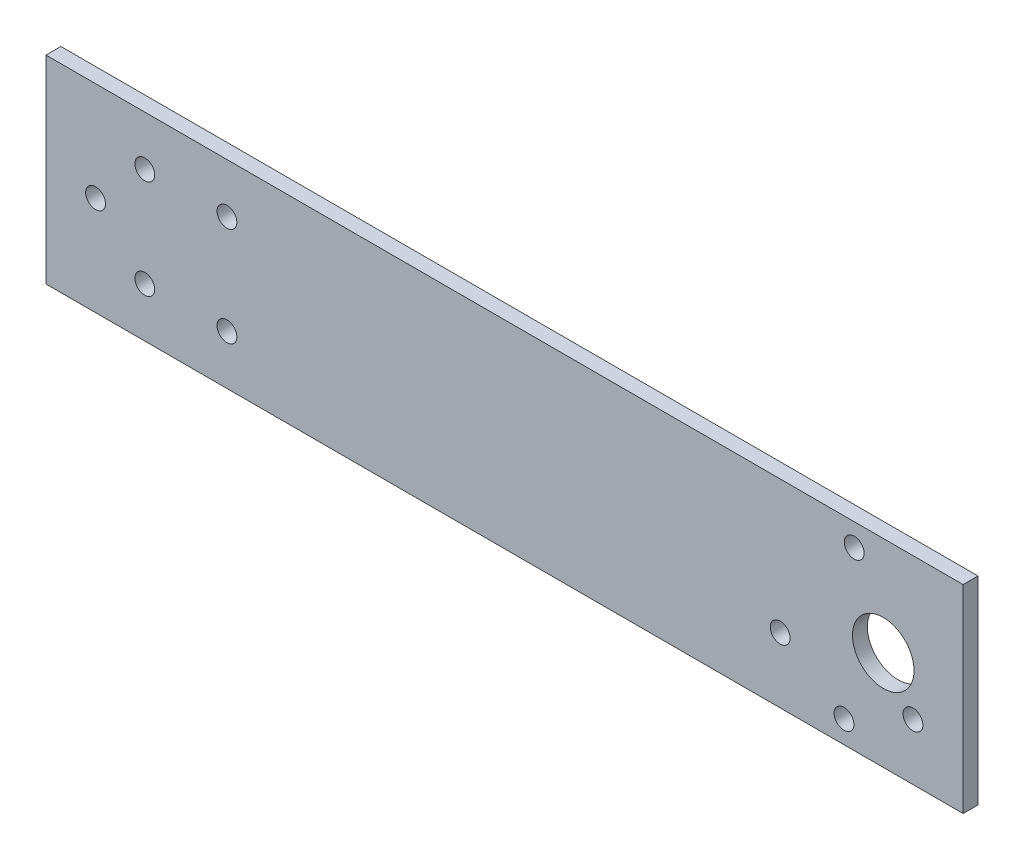
ISO-10303-21;
HEADER;
FILE_DESCRIPTION(('STEP AP214'),'2;1');
FILE_NAME('part.step','',(''),(''),'','','');
FILE_SCHEMA(('AUTOMOTIVE_DESIGN { 1 0 10303 214 1 1 1 1 }'));
ENDSEC;
DATA;
#1=APPLICATION_CONTEXT('core data for automotive mechanical design processes');
#2=APPLICATION_PROTOCOL_DEFINITION('international standard','automotive_design',2000,#1);
#3=PRODUCT_CONTEXT('',#1,'mechanical');
#4=PRODUCT('Part','Part','',(#3));
#5=PRODUCT_RELATED_PRODUCT_CATEGORY('part','',(#4));
#6=PRODUCT_DEFINITION_FORMATION('','',#4);
#7=PRODUCT_DEFINITION_CONTEXT('part definition',#1,'design');
#8=PRODUCT_DEFINITION('design','',#6,#7);
#9=PRODUCT_DEFINITION_SHAPE('','',#8);
#10=(LENGTH_UNIT() NAMED_UNIT(*) SI_UNIT(.MILLI.,.METRE.));
#11=(NAMED_UNIT(*) PLANE_ANGLE_UNIT() SI_UNIT($,.RADIAN.));
#12=(NAMED_UNIT(*) SI_UNIT($,.STERADIAN.) SOLID_ANGLE_UNIT());
#13=UNCERTAINTY_MEASURE_WITH_UNIT(LENGTH_MEASURE(1.E-05),#10,'distance_accuracy_value','');
#14=(GEOMETRIC_REPRESENTATION_CONTEXT(3) GLOBAL_UNCERTAINTY_ASSIGNED_CONTEXT((#13)) GLOBAL_UNIT_ASSIGNED_CONTEXT((#10,
#11,#12)) REPRESENTATION_CONTEXT('',''));
#15=CARTESIAN_POINT('',(0.,0.,0.));
#16=DIRECTION('',(0.,0.,1.));
#17=DIRECTION('',(1.,0.,0.));
#18=AXIS2_PLACEMENT_3D('',#15,#16,#17);
#19=CARTESIAN_POINT('',(185.,0.,3.));
#20=DIRECTION('',(1.,0.,0.));
#21=DIRECTION('',(0.,0.,-1.));
#22=AXIS2_PLACEMENT_3D('',#19,#20,#21);
#23=PLANE('',#22);
#24=DIRECTION('',(0.,-1.,0.));
#25=VECTOR('',#24,1.);
#26=CARTESIAN_POINT('',(185.,0.,0.));
#27=LINE('',#26,#25);
#28=CARTESIAN_POINT('',(185.,40.,0.));
#29=VERTEX_POINT('',#28);
#30=CARTESIAN_POINT('',(185.,0.,0.));
#31=VERTEX_POINT('',#30);
#32=EDGE_CURVE('E127',#29,#31,#27,.T.);
#33=ORIENTED_EDGE('',*,*,#32,.F.);
#34=DIRECTION('',(0.,0.,-1.));
#35=VECTOR('',#34,1.);
#36=CARTESIAN_POINT('',(185.,40.,3.));
#37=LINE('',#36,#35);
#38=CARTESIAN_POINT('',(185.,40.,3.));
#39=VERTEX_POINT('',#38);
#40=EDGE_CURVE('E11',#39,#29,#37,.T.);
#41=ORIENTED_EDGE('',*,*,#40,.F.);
#42=DIRECTION('',(0.,-1.,0.));
#43=VECTOR('',#42,1.);
#44=CARTESIAN_POINT('',(185.,0.,3.));
#45=LINE('',#44,#43);
#46=CARTESIAN_POINT('',(185.,0.,3.));
#47=VERTEX_POINT('',#46);
#48=EDGE_CURVE('E90',#39,#47,#45,.T.);
#49=ORIENTED_EDGE('',*,*,#48,.T.);
#50=DIRECTION('',(0.,0.,-1.));
#51=VECTOR('',#50,1.);
#52=CARTESIAN_POINT('',(185.,0.,3.));
#53=LINE('',#52,#51);
#54=EDGE_CURVE('E72',#47,#31,#53,.T.);
#55=ORIENTED_EDGE('',*,*,#54,.T.);
#56=EDGE_LOOP('',(#33,#41,#49,#55));
#57=FACE_BOUND('',#56,.T.);
#58=ADVANCED_FACE('F33',(#57),#23,.T.);
#59=CARTESIAN_POINT('',(0.,40.,3.));
#60=DIRECTION('',(0.,1.,0.));
#61=DIRECTION('',(0.,0.,1.));
#62=AXIS2_PLACEMENT_3D('',#59,#60,#61);
#63=PLANE('',#62);
#64=DIRECTION('',(1.,0.,0.));
#65=VECTOR('',#64,1.);
#66=CARTESIAN_POINT('',(0.,40.,0.));
#67=LINE('',#66,#65);
#68=CARTESIAN_POINT('',(0.,40.,0.));
#69=VERTEX_POINT('',#68);
#70=EDGE_CURVE('E83',#69,#29,#67,.T.);
#71=ORIENTED_EDGE('',*,*,#70,.F.);
#72=DIRECTION('',(0.,0.,-1.));
#73=VECTOR('',#72,1.);
#74=CARTESIAN_POINT('',(0.,40.,3.));
#75=LINE('',#74,#73);
#76=CARTESIAN_POINT('',(0.,40.,3.));
#77=VERTEX_POINT('',#76);
#78=EDGE_CURVE('E42',#77,#69,#75,.T.);
#79=ORIENTED_EDGE('',*,*,#78,.F.);
#80=DIRECTION('',(1.,0.,0.));
#81=VECTOR('',#80,1.);
#82=CARTESIAN_POINT('',(0.,40.,3.));
#83=LINE('',#82,#81);
#84=EDGE_CURVE('E81',#77,#39,#83,.T.);
#85=ORIENTED_EDGE('',*,*,#84,.T.);
#86=ORIENTED_EDGE('',*,*,#40,.T.);
#87=EDGE_LOOP('',(#71,#79,#85,#86));
#88=FACE_BOUND('',#87,.T.);
#89=ADVANCED_FACE('F80',(#88),#63,.T.);
#90=CARTESIAN_POINT('',(0.,0.,3.));
#91=DIRECTION('',(-1.,0.,0.));
#92=DIRECTION('',(0.,0.,1.));
#93=AXIS2_PLACEMENT_3D('',#90,#91,#92);
#94=PLANE('',#93);
#95=DIRECTION('',(0.,1.,0.));
#96=VECTOR('',#95,1.);
#97=CARTESIAN_POINT('',(0.,0.,0.));
#98=LINE('',#97,#96);
#99=CARTESIAN_POINT('',(0.,0.,0.));
#100=VERTEX_POINT('',#99);
#101=EDGE_CURVE('E131',#100,#69,#98,.T.);
#102=ORIENTED_EDGE('',*,*,#101,.F.);
#103=DIRECTION('',(0.,0.,-1.));
#104=VECTOR('',#103,1.);
#105=CARTESIAN_POINT('',(0.,0.,3.));
#106=LINE('',#105,#104);
#107=CARTESIAN_POINT('',(0.,0.,3.));
#108=VERTEX_POINT('',#107);
#109=EDGE_CURVE('E65',#108,#100,#106,.T.);
#110=ORIENTED_EDGE('',*,*,#109,.F.);
#111=DIRECTION('',(0.,1.,0.));
#112=VECTOR('',#111,1.);
#113=CARTESIAN_POINT('',(0.,0.,3.));
#114=LINE('',#113,#112);
#115=EDGE_CURVE('E89',#108,#77,#114,.T.);
#116=ORIENTED_EDGE('',*,*,#115,.T.);
#117=ORIENTED_EDGE('',*,*,#78,.T.);
#118=EDGE_LOOP('',(#102,#110,#116,#117));
#119=FACE_BOUND('',#118,.T.);
#120=ADVANCED_FACE('F92',(#119),#94,.T.);
#121=CARTESIAN_POINT('',(10.,20.,3.));
#122=DIRECTION('',(0.,0.,-1.));
#123=DIRECTION('',(-1.,0.,0.));
#124=AXIS2_PLACEMENT_3D('',#121,#122,#123);
#125=CYLINDRICAL_SURFACE('',#124,2.);
#126=CARTESIAN_POINT('',(10.,20.,3.));
#127=DIRECTION('',(0.,0.,1.));
#128=DIRECTION('',(1.,0.,0.));
#129=AXIS2_PLACEMENT_3D('',#126,#127,#128);
#130=CIRCLE('',#129,2.);
#131=CARTESIAN_POINT('',(12.,20.,3.));
#132=VERTEX_POINT('',#131);
#133=EDGE_CURVE('E166',#132,#132,#130,.T.);
#134=ORIENTED_EDGE('',*,*,#133,.T.);
#135=EDGE_LOOP('',(#134));
#136=FACE_BOUND('',#135,.T.);
#137=CARTESIAN_POINT('',(10.,20.,0.));
#138=DIRECTION('',(0.,0.,1.));
#139=DIRECTION('',(1.,0.,0.));
#140=AXIS2_PLACEMENT_3D('',#137,#138,#139);
#141=CIRCLE('',#140,2.);
#142=CARTESIAN_POINT('',(12.,20.,0.));
#143=VERTEX_POINT('',#142);
#144=EDGE_CURVE('E124',#143,#143,#141,.T.);
#145=ORIENTED_EDGE('',*,*,#144,.F.);
#146=EDGE_LOOP('',(#145));
#147=FACE_BOUND('',#146,.T.);
#148=ADVANCED_FACE('F176',(#136,#147),#125,.F.);
#149=CARTESIAN_POINT('',(19.9302505368166,10.,3.));
#150=DIRECTION('',(0.,0.,-1.));
#151=DIRECTION('',(-1.,0.,0.));
#152=AXIS2_PLACEMENT_3D('',#149,#150,#151);
#153=CYLINDRICAL_SURFACE('',#152,2.);
#154=CARTESIAN_POINT('',(19.9302505368166,10.,3.));
#155=DIRECTION('',(0.,0.,1.));
#156=DIRECTION('',(1.,0.,0.));
#157=AXIS2_PLACEMENT_3D('',#154,#155,#156);
#158=CIRCLE('',#157,2.);
#159=CARTESIAN_POINT('',(21.9302505368166,10.,3.));
#160=VERTEX_POINT('',#159);
#161=EDGE_CURVE('E163',#160,#160,#158,.T.);
#162=ORIENTED_EDGE('',*,*,#161,.T.);
#163=EDGE_LOOP('',(#162));
#164=FACE_BOUND('',#163,.T.);
#165=CARTESIAN_POINT('',(19.9302505368166,10.,0.));
#166=DIRECTION('',(0.,0.,1.));
#167=DIRECTION('',(1.,0.,0.));
#168=AXIS2_PLACEMENT_3D('',#165,#166,#167);
#169=CIRCLE('',#168,2.);
#170=CARTESIAN_POINT('',(21.9302505368166,10.,0.));
#171=VERTEX_POINT('',#170);
#172=EDGE_CURVE('E121',#171,#171,#169,.T.);
#173=ORIENTED_EDGE('',*,*,#172,.F.);
#174=EDGE_LOOP('',(#173));
#175=FACE_BOUND('',#174,.T.);
#176=ADVANCED_FACE('F179',(#164,#175),#153,.F.);
#177=CARTESIAN_POINT('',(19.9302505368166,30.,3.));
#178=DIRECTION('',(0.,0.,-1.));
#179=DIRECTION('',(-1.,0.,0.));
#180=AXIS2_PLACEMENT_3D('',#177,#178,#179);
#181=CYLINDRICAL_SURFACE('',#180,2.);
#182=CARTESIAN_POINT('',(19.9302505368166,30.,3.));
#183=DIRECTION('',(0.,0.,1.));
#184=DIRECTION('',(1.,0.,0.));
#185=AXIS2_PLACEMENT_3D('',#182,#183,#184);
#186=CIRCLE('',#185,2.);
#187=CARTESIAN_POINT('',(21.9302505368166,30.,3.));
#188=VERTEX_POINT('',#187);
#189=EDGE_CURVE('E160',#188,#188,#186,.T.);
#190=ORIENTED_EDGE('',*,*,#189,.T.);
#191=EDGE_LOOP('',(#190));
#192=FACE_BOUND('',#191,.T.);
#193=CARTESIAN_POINT('',(19.9302505368166,30.,0.));
#194=DIRECTION('',(0.,0.,1.));
#195=DIRECTION('',(1.,0.,0.));
#196=AXIS2_PLACEMENT_3D('',#193,#194,#195);
#197=CIRCLE('',#196,2.);
#198=CARTESIAN_POINT('',(21.9302505368166,30.,0.));
#199=VERTEX_POINT('',#198);
#200=EDGE_CURVE('E118',#199,#199,#197,.T.);
#201=ORIENTED_EDGE('',*,*,#200,.F.);
#202=EDGE_LOOP('',(#201));
#203=FACE_BOUND('',#202,.T.);
#204=ADVANCED_FACE('F183',(#192,#203),#181,.F.);
#205=CARTESIAN_POINT('',(160.970927527003,4.53419607008805,3.));
#206=DIRECTION('',(0.,0.,-1.));
#207=DIRECTION('',(-1.,0.,0.));
#208=AXIS2_PLACEMENT_3D('',#205,#206,#207);
#209=CYLINDRICAL_SURFACE('',#208,1.99999999999997);
#210=CARTESIAN_POINT('',(160.970927527003,4.53419607008805,3.));
#211=DIRECTION('',(0.,0.,1.));
#212=DIRECTION('',(1.,0.,0.));
#213=AXIS2_PLACEMENT_3D('',#210,#211,#212);
#214=CIRCLE('',#213,1.99999999999997);
#215=CARTESIAN_POINT('',(162.970927527003,4.53419607008805,3.));
#216=VERTEX_POINT('',#215);
#217=EDGE_CURVE('E157',#216,#216,#214,.T.);
#218=ORIENTED_EDGE('',*,*,#217,.T.);
#219=EDGE_LOOP('',(#218));
#220=FACE_BOUND('',#219,.T.);
#221=CARTESIAN_POINT('',(160.970927527003,4.53419607008805,0.));
#222=DIRECTION('',(0.,0.,1.));
#223=DIRECTION('',(1.,0.,0.));
#224=AXIS2_PLACEMENT_3D('',#221,#222,#223);
#225=CIRCLE('',#224,1.99999999999997);
#226=CARTESIAN_POINT('',(162.970927527003,4.53419607008805,0.));
#227=VERTEX_POINT('',#226);
#228=EDGE_CURVE('E115',#227,#227,#225,.T.);
#229=ORIENTED_EDGE('',*,*,#228,.F.);
#230=EDGE_LOOP('',(#229));
#231=FACE_BOUND('',#230,.T.);
#232=ADVANCED_FACE('F187',(#220,#231),#209,.F.);
#233=CARTESIAN_POINT('',(148.091684171163,13.1582954770424,3.));
#234=DIRECTION('',(0.,0.,-1.));
#235=DIRECTION('',(-1.,0.,0.));
#236=AXIS2_PLACEMENT_3D('',#233,#234,#235);
#237=CYLINDRICAL_SURFACE('',#236,1.99999999999997);
#238=CARTESIAN_POINT('',(148.091684171163,13.1582954770424,3.));
#239=DIRECTION('',(0.,0.,1.));
#240=DIRECTION('',(1.,0.,0.));
#241=AXIS2_PLACEMENT_3D('',#238,#239,#240);
#242=CIRCLE('',#241,1.99999999999997);
#243=CARTESIAN_POINT('',(150.091684171163,13.1582954770424,3.));
#244=VERTEX_POINT('',#243);
#245=EDGE_CURVE('E154',#244,#244,#242,.T.);
#246=ORIENTED_EDGE('',*,*,#245,.T.);
#247=EDGE_LOOP('',(#246));
#248=FACE_BOUND('',#247,.T.);
#249=CARTESIAN_POINT('',(148.091684171163,13.1582954770424,0.));
#250=DIRECTION('',(0.,0.,1.));
#251=DIRECTION('',(1.,0.,0.));
#252=AXIS2_PLACEMENT_3D('',#249,#250,#251);
#253=CIRCLE('',#252,1.99999999999997);
#254=CARTESIAN_POINT('',(150.091684171163,13.1582954770424,0.));
#255=VERTEX_POINT('',#254);
#256=EDGE_CURVE('E112',#255,#255,#253,.T.);
#257=ORIENTED_EDGE('',*,*,#256,.F.);
#258=EDGE_LOOP('',(#257));
#259=FACE_BOUND('',#258,.T.);
#260=ADVANCED_FACE('F191',(#248,#259),#237,.F.);
#261=CARTESIAN_POINT('',(174.879238376109,11.3758982942909,3.));
#262=DIRECTION('',(0.,0.,-1.));
#263=DIRECTION('',(-1.,0.,0.));
#264=AXIS2_PLACEMENT_3D('',#261,#262,#263);
#265=CYLINDRICAL_SURFACE('',#264,2.);
#266=CARTESIAN_POINT('',(174.879238376109,11.3758982942909,3.));
#267=DIRECTION('',(0.,0.,1.));
#268=DIRECTION('',(1.,0.,0.));
#269=AXIS2_PLACEMENT_3D('',#266,#267,#268);
#270=CIRCLE('',#269,2.);
#271=CARTESIAN_POINT('',(176.879238376109,11.3758982942909,3.));
#272=VERTEX_POINT('',#271);
#273=EDGE_CURVE('E151',#272,#272,#270,.T.);
#274=ORIENTED_EDGE('',*,*,#273,.T.);
#275=EDGE_LOOP('',(#274));
#276=FACE_BOUND('',#275,.T.);
#277=CARTESIAN_POINT('',(174.879238376109,11.3758982942909,0.));
#278=DIRECTION('',(0.,0.,1.));
#279=DIRECTION('',(1.,0.,0.));
#280=AXIS2_PLACEMENT_3D('',#277,#278,#279);
#281=CIRCLE('',#280,2.);
#282=CARTESIAN_POINT('',(176.879238376109,11.3758982942909,0.));
#283=VERTEX_POINT('',#282);
#284=EDGE_CURVE('E109',#283,#283,#281,.T.);
#285=ORIENTED_EDGE('',*,*,#284,.F.);
#286=EDGE_LOOP('',(#285));
#287=FACE_BOUND('',#286,.T.);
#288=ADVANCED_FACE('F195',(#276,#287),#265,.F.);
#289=CARTESIAN_POINT('',(163.029062513532,35.4657993324025,3.));
#290=DIRECTION('',(0.,0.,-1.));
#291=DIRECTION('',(-1.,0.,0.));
#292=AXIS2_PLACEMENT_3D('',#289,#290,#291);
#293=CYLINDRICAL_SURFACE('',#292,2.);
#294=CARTESIAN_POINT('',(163.029062513532,35.4657993324025,3.));
#295=DIRECTION('',(0.,0.,1.));
#296=DIRECTION('',(1.,0.,0.));
#297=AXIS2_PLACEMENT_3D('',#294,#295,#296);
#298=CIRCLE('',#297,2.);
#299=CARTESIAN_POINT('',(165.029062513532,35.4657993324025,3.));
#300=VERTEX_POINT('',#299);
#301=EDGE_CURVE('E148',#300,#300,#298,.T.);
#302=ORIENTED_EDGE('',*,*,#301,.T.);
#303=EDGE_LOOP('',(#302));
#304=FACE_BOUND('',#303,.T.);
#305=CARTESIAN_POINT('',(163.029062513532,35.4657993324025,0.));
#306=DIRECTION('',(0.,0.,1.));
#307=DIRECTION('',(1.,0.,0.));
#308=AXIS2_PLACEMENT_3D('',#305,#306,#307);
#309=CIRCLE('',#308,2.);
#310=CARTESIAN_POINT('',(165.029062513532,35.4657993324025,0.));
#311=VERTEX_POINT('',#310);
#312=EDGE_CURVE('E106',#311,#311,#309,.T.);
#313=ORIENTED_EDGE('',*,*,#312,.F.);
#314=EDGE_LOOP('',(#313));
#315=FACE_BOUND('',#314,.T.);
#316=ADVANCED_FACE('F199',(#304,#315),#293,.F.);
#317=CARTESIAN_POINT('',(168.88405573592,19.9999977001329,3.));
#318=DIRECTION('',(0.,0.,-1.));
#319=DIRECTION('',(-1.,0.,0.));
#320=AXIS2_PLACEMENT_3D('',#317,#318,#319);
#321=CYLINDRICAL_SURFACE('',#320,6.20704278040508);
#322=CARTESIAN_POINT('',(168.88405573592,19.9999977001329,3.));
#323=DIRECTION('',(0.,0.,1.));
#324=DIRECTION('',(1.,0.,0.));
#325=AXIS2_PLACEMENT_3D('',#322,#323,#324);
#326=CIRCLE('',#325,6.20704278040508);
#327=CARTESIAN_POINT('',(175.091098516325,19.9999977001329,3.));
#328=VERTEX_POINT('',#327);
#329=EDGE_CURVE('E143',#328,#328,#326,.T.);
#330=ORIENTED_EDGE('',*,*,#329,.T.);
#331=EDGE_LOOP('',(#330));
#332=FACE_BOUND('',#331,.T.);
#333=CARTESIAN_POINT('',(168.88405573592,19.9999977001329,0.));
#334=DIRECTION('',(0.,0.,1.));
#335=DIRECTION('',(1.,0.,0.));
#336=AXIS2_PLACEMENT_3D('',#333,#334,#335);
#337=CIRCLE('',#336,6.20704278040508);
#338=CARTESIAN_POINT('',(175.091098516325,19.9999977001329,0.));
#339=VERTEX_POINT('',#338);
#340=EDGE_CURVE('E103',#339,#339,#337,.T.);
#341=ORIENTED_EDGE('',*,*,#340,.F.);
#342=EDGE_LOOP('',(#341));
#343=FACE_BOUND('',#342,.T.);
#344=ADVANCED_FACE('F203',(#332,#343),#321,.F.);
#345=CARTESIAN_POINT('',(36.5,30.,3.));
#346=DIRECTION('',(0.,0.,-1.));
#347=DIRECTION('',(-1.,0.,0.));
#348=AXIS2_PLACEMENT_3D('',#345,#346,#347);
#349=CYLINDRICAL_SURFACE('',#348,2.);
#350=CARTESIAN_POINT('',(36.5,30.,3.));
#351=DIRECTION('',(0.,0.,1.));
#352=DIRECTION('',(1.,0.,0.));
#353=AXIS2_PLACEMENT_3D('',#350,#351,#352);
#354=CIRCLE('',#353,2.);
#355=CARTESIAN_POINT('',(38.5,30.,3.));
#356=VERTEX_POINT('',#355);
#357=EDGE_CURVE('E138',#356,#356,#354,.T.);
#358=ORIENTED_EDGE('',*,*,#357,.T.);
#359=EDGE_LOOP('',(#358));
#360=FACE_BOUND('',#359,.T.);
#361=CARTESIAN_POINT('',(36.5,30.,0.));
#362=DIRECTION('',(0.,0.,1.));
#363=DIRECTION('',(1.,0.,0.));
#364=AXIS2_PLACEMENT_3D('',#361,#362,#363);
#365=CIRCLE('',#364,2.);
#366=CARTESIAN_POINT('',(38.5,30.,0.));
#367=VERTEX_POINT('',#366);
#368=EDGE_CURVE('E100',#367,#367,#365,.T.);
#369=ORIENTED_EDGE('',*,*,#368,.F.);
#370=EDGE_LOOP('',(#369));
#371=FACE_BOUND('',#370,.T.);
#372=ADVANCED_FACE('F206',(#360,#371),#349,.F.);
#373=CARTESIAN_POINT('',(36.5,10.,3.));
#374=DIRECTION('',(0.,0.,-1.));
#375=DIRECTION('',(-1.,0.,0.));
#376=AXIS2_PLACEMENT_3D('',#373,#374,#375);
#377=CYLINDRICAL_SURFACE('',#376,2.);
#378=CARTESIAN_POINT('',(36.5,10.,3.));
#379=DIRECTION('',(0.,0.,1.));
#380=DIRECTION('',(1.,0.,0.));
#381=AXIS2_PLACEMENT_3D('',#378,#379,#380);
#382=CIRCLE('',#381,2.);
#383=CARTESIAN_POINT('',(38.5,10.,3.));
#384=VERTEX_POINT('',#383);
#385=EDGE_CURVE('E135',#384,#384,#382,.T.);
#386=ORIENTED_EDGE('',*,*,#385,.T.);
#387=EDGE_LOOP('',(#386));
#388=FACE_BOUND('',#387,.T.);
#389=CARTESIAN_POINT('',(36.5,10.,0.));
#390=DIRECTION('',(0.,0.,1.));
#391=DIRECTION('',(1.,0.,0.));
#392=AXIS2_PLACEMENT_3D('',#389,#390,#391);
#393=CIRCLE('',#392,2.);
#394=CARTESIAN_POINT('',(38.5,10.,0.));
#395=VERTEX_POINT('',#394);
#396=EDGE_CURVE('E97',#395,#395,#393,.T.);
#397=ORIENTED_EDGE('',*,*,#396,.F.);
#398=EDGE_LOOP('',(#397));
#399=FACE_BOUND('',#398,.T.);
#400=ADVANCED_FACE('F35',(#388,#399),#377,.F.);
#401=CARTESIAN_POINT('',(0.,0.,3.));
#402=DIRECTION('',(0.,1.,0.));
#403=DIRECTION('',(0.,0.,1.));
#404=AXIS2_PLACEMENT_3D('',#401,#402,#403);
#405=PLANE('',#404);
#406=DIRECTION('',(1.,0.,0.));
#407=VECTOR('',#406,1.);
#408=CARTESIAN_POINT('',(0.,0.,0.));
#409=LINE('',#408,#407);
#410=EDGE_CURVE('E133',#100,#31,#409,.T.);
#411=ORIENTED_EDGE('',*,*,#410,.T.);
#412=ORIENTED_EDGE('',*,*,#54,.F.);
#413=DIRECTION('',(1.,0.,0.));
#414=VECTOR('',#413,1.);
#415=CARTESIAN_POINT('',(0.,0.,3.));
#416=LINE('',#415,#414);
#417=EDGE_CURVE('E50',#108,#47,#416,.T.);
#418=ORIENTED_EDGE('',*,*,#417,.F.);
#419=ORIENTED_EDGE('',*,*,#109,.T.);
#420=EDGE_LOOP('',(#411,#412,#418,#419));
#421=FACE_BOUND('',#420,.T.);
#422=ADVANCED_FACE('F213',(#421),#405,.F.);
#423=CARTESIAN_POINT('',(0.,0.,3.));
#424=DIRECTION('',(0.,0.,1.));
#425=DIRECTION('',(1.,0.,0.));
#426=AXIS2_PLACEMENT_3D('',#423,#424,#425);
#427=PLANE('',#426);
#428=ORIENTED_EDGE('',*,*,#385,.F.);
#429=EDGE_LOOP('',(#428));
#430=FACE_BOUND('',#429,.T.);
#431=ORIENTED_EDGE('',*,*,#357,.F.);
#432=EDGE_LOOP('',(#431));
#433=FACE_BOUND('',#432,.T.);
#434=ORIENTED_EDGE('',*,*,#329,.F.);
#435=EDGE_LOOP('',(#434));
#436=FACE_BOUND('',#435,.T.);
#437=ORIENTED_EDGE('',*,*,#301,.F.);
#438=EDGE_LOOP('',(#437));
#439=FACE_BOUND('',#438,.T.);
#440=ORIENTED_EDGE('',*,*,#273,.F.);
#441=EDGE_LOOP('',(#440));
#442=FACE_BOUND('',#441,.T.);
#443=ORIENTED_EDGE('',*,*,#245,.F.);
#444=EDGE_LOOP('',(#443));
#445=FACE_BOUND('',#444,.T.);
#446=ORIENTED_EDGE('',*,*,#217,.F.);
#447=EDGE_LOOP('',(#446));
#448=FACE_BOUND('',#447,.T.);
#449=ORIENTED_EDGE('',*,*,#189,.F.);
#450=EDGE_LOOP('',(#449));
#451=FACE_BOUND('',#450,.T.);
#452=ORIENTED_EDGE('',*,*,#161,.F.);
#453=EDGE_LOOP('',(#452));
#454=FACE_BOUND('',#453,.T.);
#455=ORIENTED_EDGE('',*,*,#133,.F.);
#456=EDGE_LOOP('',(#455));
#457=FACE_BOUND('',#456,.T.);
#458=ORIENTED_EDGE('',*,*,#48,.F.);
#459=ORIENTED_EDGE('',*,*,#84,.F.);
#460=ORIENTED_EDGE('',*,*,#115,.F.);
#461=ORIENTED_EDGE('',*,*,#417,.T.);
#462=EDGE_LOOP('',(#458,#459,#460,#461));
#463=FACE_BOUND('',#462,.T.);
#464=ADVANCED_FACE('F88',(#430,#433,#436,#439,#442,#445,#448,#451,#454,#457,#463),#427,.T.);
#465=CARTESIAN_POINT('',(0.,0.,0.));
#466=DIRECTION('',(0.,0.,1.));
#467=DIRECTION('',(1.,0.,0.));
#468=AXIS2_PLACEMENT_3D('',#465,#466,#467);
#469=PLANE('',#468);
#470=ORIENTED_EDGE('',*,*,#396,.T.);
#471=EDGE_LOOP('',(#470));
#472=FACE_BOUND('',#471,.T.);
#473=ORIENTED_EDGE('',*,*,#368,.T.);
#474=EDGE_LOOP('',(#473));
#475=FACE_BOUND('',#474,.T.);
#476=ORIENTED_EDGE('',*,*,#340,.T.);
#477=EDGE_LOOP('',(#476));
#478=FACE_BOUND('',#477,.T.);
#479=ORIENTED_EDGE('',*,*,#312,.T.);
#480=EDGE_LOOP('',(#479));
#481=FACE_BOUND('',#480,.T.);
#482=ORIENTED_EDGE('',*,*,#284,.T.);
#483=EDGE_LOOP('',(#482));
#484=FACE_BOUND('',#483,.T.);
#485=ORIENTED_EDGE('',*,*,#256,.T.);
#486=EDGE_LOOP('',(#485));
#487=FACE_BOUND('',#486,.T.);
#488=ORIENTED_EDGE('',*,*,#228,.T.);
#489=EDGE_LOOP('',(#488));
#490=FACE_BOUND('',#489,.T.);
#491=ORIENTED_EDGE('',*,*,#200,.T.);
#492=EDGE_LOOP('',(#491));
#493=FACE_BOUND('',#492,.T.);
#494=ORIENTED_EDGE('',*,*,#172,.T.);
#495=EDGE_LOOP('',(#494));
#496=FACE_BOUND('',#495,.T.);
#497=ORIENTED_EDGE('',*,*,#144,.T.);
#498=EDGE_LOOP('',(#497));
#499=FACE_BOUND('',#498,.T.);
#500=ORIENTED_EDGE('',*,*,#32,.T.);
#501=ORIENTED_EDGE('',*,*,#410,.F.);
#502=ORIENTED_EDGE('',*,*,#101,.T.);
#503=ORIENTED_EDGE('',*,*,#70,.T.);
#504=EDGE_LOOP('',(#500,#501,#502,#503));
#505=FACE_BOUND('',#504,.T.);
#506=ADVANCED_FACE('F218',(#472,#475,#478,#481,#484,#487,#490,#493,#496,#499,#505),#469,.F.);
#507=CLOSED_SHELL('',(#58,#89,#120,#148,#176,#204,#232,#260,#288,#316,#344,#372,#400,#422,#464,#506));
#508=MANIFOLD_SOLID_BREP('B2',#507);
#509=ADVANCED_BREP_SHAPE_REPRESENTATION('',(#18,#508),#14);
#510=SHAPE_DEFINITION_REPRESENTATION(#9,#509);
ENDSEC;
END-ISO-10303-21;
